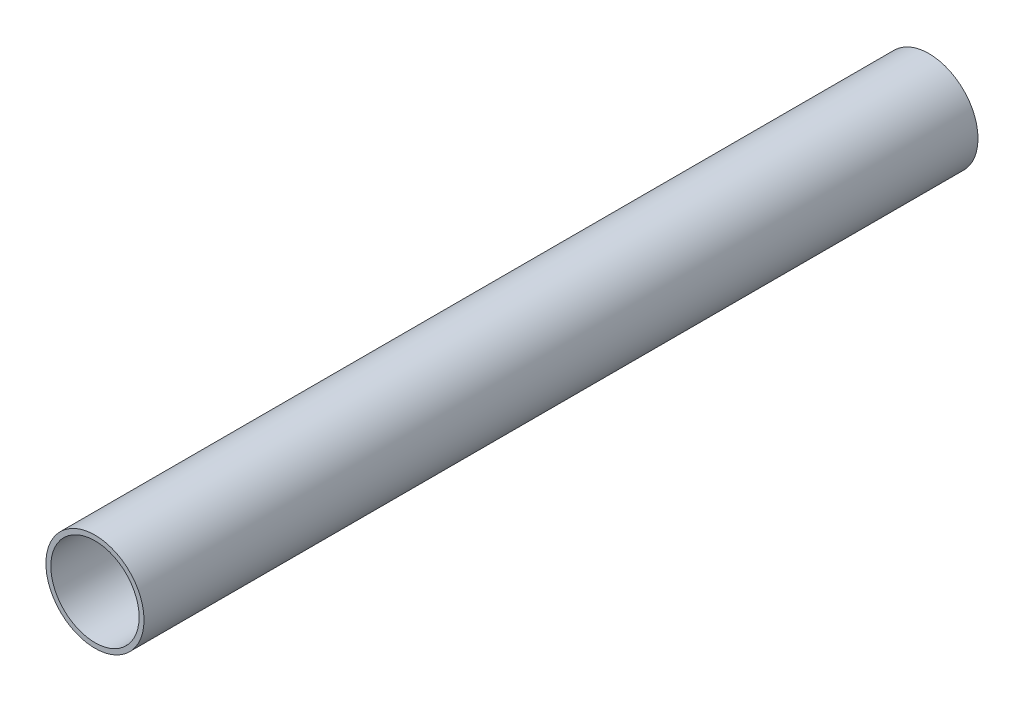
ISO-10303-21;
HEADER;
FILE_DESCRIPTION(('STEP AP214'),'2;1');
FILE_NAME('part.step','',(''),(''),'','','');
FILE_SCHEMA(('AUTOMOTIVE_DESIGN { 1 0 10303 214 1 1 1 1 }'));
ENDSEC;
DATA;
#1=APPLICATION_CONTEXT('core data for automotive mechanical design processes');
#2=APPLICATION_PROTOCOL_DEFINITION('international standard','automotive_design',2000,#1);
#3=PRODUCT_CONTEXT('',#1,'mechanical');
#4=PRODUCT('Part','Part','',(#3));
#5=PRODUCT_RELATED_PRODUCT_CATEGORY('part','',(#4));
#6=PRODUCT_DEFINITION_FORMATION('','',#4);
#7=PRODUCT_DEFINITION_CONTEXT('part definition',#1,'design');
#8=PRODUCT_DEFINITION('design','',#6,#7);
#9=PRODUCT_DEFINITION_SHAPE('','',#8);
#10=(LENGTH_UNIT() NAMED_UNIT(*) SI_UNIT(.MILLI.,.METRE.));
#11=(NAMED_UNIT(*) PLANE_ANGLE_UNIT() SI_UNIT($,.RADIAN.));
#12=(NAMED_UNIT(*) SI_UNIT($,.STERADIAN.) SOLID_ANGLE_UNIT());
#13=UNCERTAINTY_MEASURE_WITH_UNIT(LENGTH_MEASURE(1.E-05),#10,'distance_accuracy_value','');
#14=(GEOMETRIC_REPRESENTATION_CONTEXT(3) GLOBAL_UNCERTAINTY_ASSIGNED_CONTEXT((#13)) GLOBAL_UNIT_ASSIGNED_CONTEXT((#10,
#11,#12)) REPRESENTATION_CONTEXT('',''));
#15=CARTESIAN_POINT('',(0.,0.,0.));
#16=DIRECTION('',(0.,0.,1.));
#17=DIRECTION('',(1.,0.,0.));
#18=AXIS2_PLACEMENT_3D('',#15,#16,#17);
#19=CARTESIAN_POINT('',(0.,0.,170.));
#20=DIRECTION('',(0.,0.,1.));
#21=DIRECTION('',(1.,0.,0.));
#22=AXIS2_PLACEMENT_3D('',#19,#20,#21);
#23=PLANE('',#22);
#24=CARTESIAN_POINT('',(0.,0.,170.));
#25=DIRECTION('',(0.,0.,1.));
#26=DIRECTION('',(1.,0.,0.));
#27=AXIS2_PLACEMENT_3D('',#24,#25,#26);
#28=CIRCLE('',#27,10.);
#29=CARTESIAN_POINT('',(10.,0.,170.));
#30=VERTEX_POINT('',#29);
#31=EDGE_CURVE('E11',#30,#30,#28,.T.);
#32=ORIENTED_EDGE('',*,*,#31,.T.);
#33=EDGE_LOOP('',(#32));
#34=FACE_BOUND('',#33,.T.);
#35=CARTESIAN_POINT('',(0.,0.,170.));
#36=DIRECTION('',(0.,0.,1.));
#37=DIRECTION('',(1.,0.,0.));
#38=AXIS2_PLACEMENT_3D('',#35,#36,#37);
#39=CIRCLE('',#38,9.);
#40=CARTESIAN_POINT('',(9.,0.,170.));
#41=VERTEX_POINT('',#40);
#42=EDGE_CURVE('E51',#41,#41,#39,.T.);
#43=ORIENTED_EDGE('',*,*,#42,.F.);
#44=EDGE_LOOP('',(#43));
#45=FACE_BOUND('',#44,.T.);
#46=ADVANCED_FACE('F40',(#34,#45),#23,.T.);
#47=CARTESIAN_POINT('',(0.,0.,0.));
#48=DIRECTION('',(0.,0.,1.));
#49=DIRECTION('',(1.,0.,0.));
#50=AXIS2_PLACEMENT_3D('',#47,#48,#49);
#51=PLANE('',#50);
#52=CARTESIAN_POINT('',(0.,0.,0.));
#53=DIRECTION('',(0.,0.,1.));
#54=DIRECTION('',(1.,0.,0.));
#55=AXIS2_PLACEMENT_3D('',#52,#53,#54);
#56=CIRCLE('',#55,10.);
#57=CARTESIAN_POINT('',(10.,0.,0.));
#58=VERTEX_POINT('',#57);
#59=EDGE_CURVE('E44',#58,#58,#56,.T.);
#60=ORIENTED_EDGE('',*,*,#59,.F.);
#61=EDGE_LOOP('',(#60));
#62=FACE_BOUND('',#61,.T.);
#63=CARTESIAN_POINT('',(0.,0.,0.));
#64=DIRECTION('',(0.,0.,1.));
#65=DIRECTION('',(1.,0.,0.));
#66=AXIS2_PLACEMENT_3D('',#63,#64,#65);
#67=CIRCLE('',#66,9.);
#68=CARTESIAN_POINT('',(9.,0.,0.));
#69=VERTEX_POINT('',#68);
#70=EDGE_CURVE('E53',#69,#69,#67,.T.);
#71=ORIENTED_EDGE('',*,*,#70,.T.);
#72=EDGE_LOOP('',(#71));
#73=FACE_BOUND('',#72,.T.);
#74=ADVANCED_FACE('F63',(#62,#73),#51,.F.);
#75=CARTESIAN_POINT('',(0.,0.,170.));
#76=DIRECTION('',(0.,0.,-1.));
#77=DIRECTION('',(-1.,0.,0.));
#78=AXIS2_PLACEMENT_3D('',#75,#76,#77);
#79=CYLINDRICAL_SURFACE('',#78,10.);
#80=ORIENTED_EDGE('',*,*,#31,.F.);
#81=EDGE_LOOP('',(#80));
#82=FACE_BOUND('',#81,.T.);
#83=ORIENTED_EDGE('',*,*,#59,.T.);
#84=EDGE_LOOP('',(#83));
#85=FACE_BOUND('',#84,.T.);
#86=ADVANCED_FACE('F42',(#82,#85),#79,.T.);
#87=CARTESIAN_POINT('',(0.,0.,170.));
#88=DIRECTION('',(0.,0.,-1.));
#89=DIRECTION('',(-1.,0.,0.));
#90=AXIS2_PLACEMENT_3D('',#87,#88,#89);
#91=CYLINDRICAL_SURFACE('',#90,9.);
#92=ORIENTED_EDGE('',*,*,#42,.T.);
#93=EDGE_LOOP('',(#92));
#94=FACE_BOUND('',#93,.T.);
#95=ORIENTED_EDGE('',*,*,#70,.F.);
#96=EDGE_LOOP('',(#95));
#97=FACE_BOUND('',#96,.T.);
#98=ADVANCED_FACE('F59',(#94,#97),#91,.F.);
#99=CLOSED_SHELL('',(#46,#74,#86,#98));
#100=MANIFOLD_SOLID_BREP('B2',#99);
#101=ADVANCED_BREP_SHAPE_REPRESENTATION('',(#18,#100),#14);
#102=SHAPE_DEFINITION_REPRESENTATION(#9,#101);
ENDSEC;
END-ISO-10303-21;
